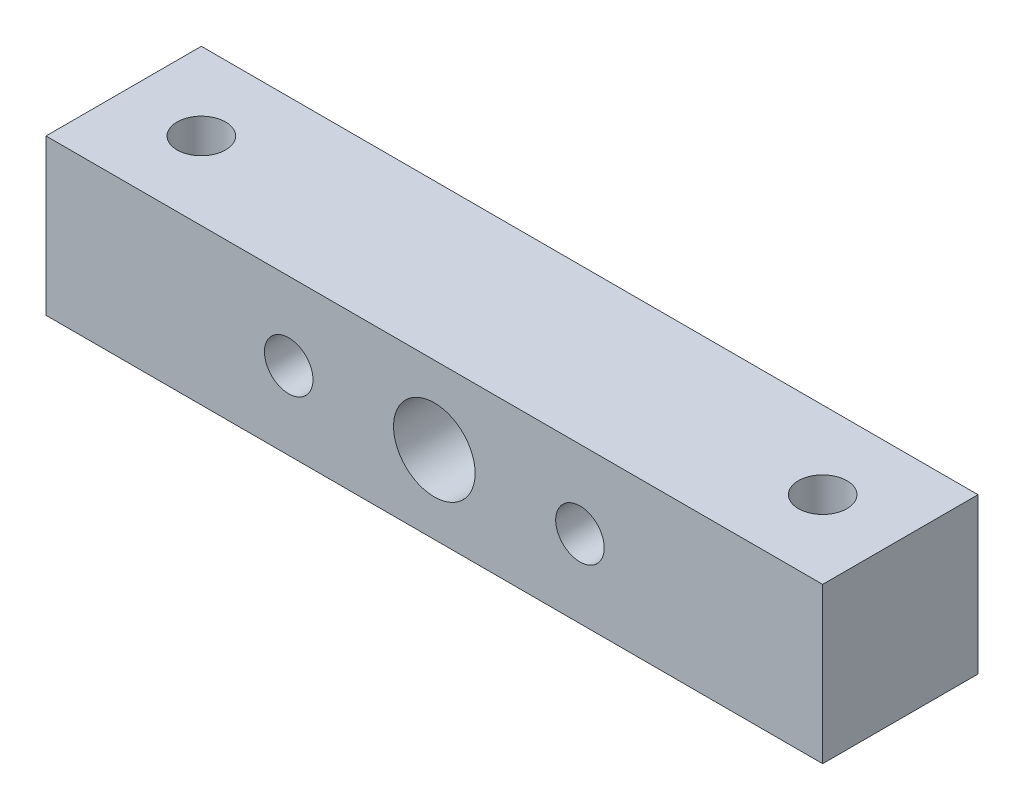
ISO-10303-21;
HEADER;
FILE_DESCRIPTION(('STEP AP214'),'2;1');
FILE_NAME('part.step','',(''),(''),'','','');
FILE_SCHEMA(('AUTOMOTIVE_DESIGN { 1 0 10303 214 1 1 1 1 }'));
ENDSEC;
DATA;
#1=APPLICATION_CONTEXT('core data for automotive mechanical design processes');
#2=APPLICATION_PROTOCOL_DEFINITION('international standard','automotive_design',2000,#1);
#3=PRODUCT_CONTEXT('',#1,'mechanical');
#4=PRODUCT('Part','Part','',(#3));
#5=PRODUCT_RELATED_PRODUCT_CATEGORY('part','',(#4));
#6=PRODUCT_DEFINITION_FORMATION('','',#4);
#7=PRODUCT_DEFINITION_CONTEXT('part definition',#1,'design');
#8=PRODUCT_DEFINITION('design','',#6,#7);
#9=PRODUCT_DEFINITION_SHAPE('','',#8);
#10=(LENGTH_UNIT() NAMED_UNIT(*) SI_UNIT(.MILLI.,.METRE.));
#11=(NAMED_UNIT(*) PLANE_ANGLE_UNIT() SI_UNIT($,.RADIAN.));
#12=(NAMED_UNIT(*) SI_UNIT($,.STERADIAN.) SOLID_ANGLE_UNIT());
#13=UNCERTAINTY_MEASURE_WITH_UNIT(LENGTH_MEASURE(1.E-05),#10,'distance_accuracy_value','');
#14=(GEOMETRIC_REPRESENTATION_CONTEXT(3) GLOBAL_UNCERTAINTY_ASSIGNED_CONTEXT((#13)) GLOBAL_UNIT_ASSIGNED_CONTEXT((#10,
#11,#12)) REPRESENTATION_CONTEXT('',''));
#15=CARTESIAN_POINT('',(0.,0.,0.));
#16=DIRECTION('',(0.,0.,1.));
#17=DIRECTION('',(1.,0.,0.));
#18=AXIS2_PLACEMENT_3D('',#15,#16,#17);
#19=CARTESIAN_POINT('',(0.,0.,8.));
#20=DIRECTION('',(0.,0.,1.));
#21=DIRECTION('',(1.,0.,0.));
#22=AXIS2_PLACEMENT_3D('',#19,#20,#21);
#23=PLANE('',#22);
#24=CARTESIAN_POINT('',(7.5,0.,8.));
#25=DIRECTION('',(0.,0.,1.));
#26=DIRECTION('',(1.,0.,0.));
#27=AXIS2_PLACEMENT_3D('',#24,#25,#26);
#28=CIRCLE('',#27,1.25);
#29=CARTESIAN_POINT('',(8.75,0.,8.));
#30=VERTEX_POINT('',#29);
#31=EDGE_CURVE('E116',#30,#30,#28,.T.);
#32=ORIENTED_EDGE('',*,*,#31,.F.);
#33=EDGE_LOOP('',(#32));
#34=FACE_BOUND('',#33,.T.);
#35=DIRECTION('',(0.,-1.,0.));
#36=VECTOR('',#35,1.);
#37=CARTESIAN_POINT('',(-20.,-4.,8.));
#38=LINE('',#37,#36);
#39=CARTESIAN_POINT('',(-20.,4.,8.));
#40=VERTEX_POINT('',#39);
#41=CARTESIAN_POINT('',(-20.,-4.,8.));
#42=VERTEX_POINT('',#41);
#43=EDGE_CURVE('E86',#40,#42,#38,.T.);
#44=ORIENTED_EDGE('',*,*,#43,.T.);
#45=DIRECTION('',(1.,0.,0.));
#46=VECTOR('',#45,1.);
#47=CARTESIAN_POINT('',(20.,-4.,8.));
#48=LINE('',#47,#46);
#49=CARTESIAN_POINT('',(20.,-4.,8.));
#50=VERTEX_POINT('',#49);
#51=EDGE_CURVE('E81',#42,#50,#48,.T.);
#52=ORIENTED_EDGE('',*,*,#51,.T.);
#53=DIRECTION('',(0.,1.,0.));
#54=VECTOR('',#53,1.);
#55=CARTESIAN_POINT('',(20.,-4.,8.));
#56=LINE('',#55,#54);
#57=CARTESIAN_POINT('',(20.,4.,8.));
#58=VERTEX_POINT('',#57);
#59=EDGE_CURVE('E84',#50,#58,#56,.T.);
#60=ORIENTED_EDGE('',*,*,#59,.T.);
#61=DIRECTION('',(-1.,0.,0.));
#62=VECTOR('',#61,1.);
#63=CARTESIAN_POINT('',(20.,4.,8.));
#64=LINE('',#63,#62);
#65=EDGE_CURVE('E51',#58,#40,#64,.T.);
#66=ORIENTED_EDGE('',*,*,#65,.T.);
#67=EDGE_LOOP('',(#44,#52,#60,#66));
#68=FACE_BOUND('',#67,.T.);
#69=CARTESIAN_POINT('',(0.,0.,8.));
#70=DIRECTION('',(0.,0.,1.));
#71=DIRECTION('',(1.,0.,0.));
#72=AXIS2_PLACEMENT_3D('',#69,#70,#71);
#73=CIRCLE('',#72,2.1);
#74=CARTESIAN_POINT('',(2.1,0.,8.));
#75=VERTEX_POINT('',#74);
#76=EDGE_CURVE('E101',#75,#75,#73,.T.);
#77=ORIENTED_EDGE('',*,*,#76,.F.);
#78=EDGE_LOOP('',(#77));
#79=FACE_BOUND('',#78,.T.);
#80=CARTESIAN_POINT('',(-7.5,0.,8.));
#81=DIRECTION('',(0.,0.,1.));
#82=DIRECTION('',(1.,0.,0.));
#83=AXIS2_PLACEMENT_3D('',#80,#81,#82);
#84=CIRCLE('',#83,1.25);
#85=CARTESIAN_POINT('',(-6.25,0.,8.));
#86=VERTEX_POINT('',#85);
#87=EDGE_CURVE('E122',#86,#86,#84,.T.);
#88=ORIENTED_EDGE('',*,*,#87,.F.);
#89=EDGE_LOOP('',(#88));
#90=FACE_BOUND('',#89,.T.);
#91=ADVANCED_FACE('F34',(#34,#68,#79,#90),#23,.T.);
#92=CARTESIAN_POINT('',(0.,0.,0.));
#93=DIRECTION('',(0.,0.,1.));
#94=DIRECTION('',(1.,0.,0.));
#95=AXIS2_PLACEMENT_3D('',#92,#93,#94);
#96=PLANE('',#95);
#97=CARTESIAN_POINT('',(7.5,0.,0.));
#98=DIRECTION('',(0.,0.,1.));
#99=DIRECTION('',(1.,0.,0.));
#100=AXIS2_PLACEMENT_3D('',#97,#98,#99);
#101=CIRCLE('',#100,1.25);
#102=CARTESIAN_POINT('',(8.75,0.,0.));
#103=VERTEX_POINT('',#102);
#104=EDGE_CURVE('E119',#103,#103,#101,.T.);
#105=ORIENTED_EDGE('',*,*,#104,.T.);
#106=EDGE_LOOP('',(#105));
#107=FACE_BOUND('',#106,.T.);
#108=DIRECTION('',(0.,-1.,0.));
#109=VECTOR('',#108,1.);
#110=CARTESIAN_POINT('',(-20.,-4.,0.));
#111=LINE('',#110,#109);
#112=CARTESIAN_POINT('',(-20.,4.,0.));
#113=VERTEX_POINT('',#112);
#114=CARTESIAN_POINT('',(-20.,-4.,0.));
#115=VERTEX_POINT('',#114);
#116=EDGE_CURVE('E98',#113,#115,#111,.T.);
#117=ORIENTED_EDGE('',*,*,#116,.F.);
#118=DIRECTION('',(-1.,0.,0.));
#119=VECTOR('',#118,1.);
#120=CARTESIAN_POINT('',(20.,4.,0.));
#121=LINE('',#120,#119);
#122=CARTESIAN_POINT('',(20.,4.,0.));
#123=VERTEX_POINT('',#122);
#124=EDGE_CURVE('E74',#123,#113,#121,.T.);
#125=ORIENTED_EDGE('',*,*,#124,.F.);
#126=DIRECTION('',(0.,1.,0.));
#127=VECTOR('',#126,1.);
#128=CARTESIAN_POINT('',(20.,-4.,0.));
#129=LINE('',#128,#127);
#130=CARTESIAN_POINT('',(20.,-4.,0.));
#131=VERTEX_POINT('',#130);
#132=EDGE_CURVE('E68',#131,#123,#129,.T.);
#133=ORIENTED_EDGE('',*,*,#132,.F.);
#134=DIRECTION('',(1.,0.,0.));
#135=VECTOR('',#134,1.);
#136=CARTESIAN_POINT('',(20.,-4.,0.));
#137=LINE('',#136,#135);
#138=EDGE_CURVE('E90',#115,#131,#137,.T.);
#139=ORIENTED_EDGE('',*,*,#138,.F.);
#140=EDGE_LOOP('',(#117,#125,#133,#139));
#141=FACE_BOUND('',#140,.T.);
#142=CARTESIAN_POINT('',(0.,0.,0.));
#143=DIRECTION('',(0.,0.,1.));
#144=DIRECTION('',(1.,0.,0.));
#145=AXIS2_PLACEMENT_3D('',#142,#143,#144);
#146=CIRCLE('',#145,2.1);
#147=CARTESIAN_POINT('',(2.1,0.,0.));
#148=VERTEX_POINT('',#147);
#149=EDGE_CURVE('E113',#148,#148,#146,.T.);
#150=ORIENTED_EDGE('',*,*,#149,.T.);
#151=EDGE_LOOP('',(#150));
#152=FACE_BOUND('',#151,.T.);
#153=CARTESIAN_POINT('',(-7.5,0.,0.));
#154=DIRECTION('',(0.,0.,1.));
#155=DIRECTION('',(1.,0.,0.));
#156=AXIS2_PLACEMENT_3D('',#153,#154,#155);
#157=CIRCLE('',#156,1.25);
#158=CARTESIAN_POINT('',(-6.25,0.,0.));
#159=VERTEX_POINT('',#158);
#160=EDGE_CURVE('E125',#159,#159,#157,.T.);
#161=ORIENTED_EDGE('',*,*,#160,.T.);
#162=EDGE_LOOP('',(#161));
#163=FACE_BOUND('',#162,.T.);
#164=ADVANCED_FACE('F109',(#107,#141,#152,#163),#96,.F.);
#165=CARTESIAN_POINT('',(-20.,-4.,8.));
#166=DIRECTION('',(1.,0.,0.));
#167=DIRECTION('',(0.,0.,-1.));
#168=AXIS2_PLACEMENT_3D('',#165,#166,#167);
#169=PLANE('',#168);
#170=ORIENTED_EDGE('',*,*,#116,.T.);
#171=DIRECTION('',(0.,0.,-1.));
#172=VECTOR('',#171,1.);
#173=CARTESIAN_POINT('',(-20.,-4.,8.));
#174=LINE('',#173,#172);
#175=EDGE_CURVE('E11',#42,#115,#174,.T.);
#176=ORIENTED_EDGE('',*,*,#175,.F.);
#177=ORIENTED_EDGE('',*,*,#43,.F.);
#178=DIRECTION('',(0.,0.,-1.));
#179=VECTOR('',#178,1.);
#180=CARTESIAN_POINT('',(-20.,4.,8.));
#181=LINE('',#180,#179);
#182=EDGE_CURVE('E94',#40,#113,#181,.T.);
#183=ORIENTED_EDGE('',*,*,#182,.T.);
#184=EDGE_LOOP('',(#170,#176,#177,#183));
#185=FACE_BOUND('',#184,.T.);
#186=ADVANCED_FACE('F36',(#185),#169,.F.);
#187=CARTESIAN_POINT('',(20.,-4.,8.));
#188=DIRECTION('',(0.,1.,0.));
#189=DIRECTION('',(-1.,0.,0.));
#190=AXIS2_PLACEMENT_3D('',#187,#188,#189);
#191=PLANE('',#190);
#192=CARTESIAN_POINT('',(16.,-4.,4.));
#193=DIRECTION('',(0.,-1.,0.));
#194=DIRECTION('',(1.,0.,0.));
#195=AXIS2_PLACEMENT_3D('',#192,#193,#194);
#196=CIRCLE('',#195,1.25);
#197=CARTESIAN_POINT('',(17.25,-4.,4.));
#198=VERTEX_POINT('',#197);
#199=EDGE_CURVE('E137',#198,#198,#196,.T.);
#200=ORIENTED_EDGE('',*,*,#199,.F.);
#201=EDGE_LOOP('',(#200));
#202=FACE_BOUND('',#201,.T.);
#203=CARTESIAN_POINT('',(-16.,-4.,4.));
#204=DIRECTION('',(0.,-1.,0.));
#205=DIRECTION('',(1.,0.,0.));
#206=AXIS2_PLACEMENT_3D('',#203,#204,#205);
#207=CIRCLE('',#206,1.25);
#208=CARTESIAN_POINT('',(-14.75,-4.,4.));
#209=VERTEX_POINT('',#208);
#210=EDGE_CURVE('E131',#209,#209,#207,.T.);
#211=ORIENTED_EDGE('',*,*,#210,.F.);
#212=EDGE_LOOP('',(#211));
#213=FACE_BOUND('',#212,.T.);
#214=ORIENTED_EDGE('',*,*,#138,.T.);
#215=DIRECTION('',(0.,0.,-1.));
#216=VECTOR('',#215,1.);
#217=CARTESIAN_POINT('',(20.,-4.,8.));
#218=LINE('',#217,#216);
#219=EDGE_CURVE('E43',#50,#131,#218,.T.);
#220=ORIENTED_EDGE('',*,*,#219,.F.);
#221=ORIENTED_EDGE('',*,*,#51,.F.);
#222=ORIENTED_EDGE('',*,*,#175,.T.);
#223=EDGE_LOOP('',(#214,#220,#221,#222));
#224=FACE_BOUND('',#223,.T.);
#225=ADVANCED_FACE('F89',(#202,#213,#224),#191,.F.);
#226=CARTESIAN_POINT('',(20.,-4.,8.));
#227=DIRECTION('',(-1.,0.,0.));
#228=DIRECTION('',(0.,0.,1.));
#229=AXIS2_PLACEMENT_3D('',#226,#227,#228);
#230=PLANE('',#229);
#231=ORIENTED_EDGE('',*,*,#132,.T.);
#232=DIRECTION('',(0.,0.,-1.));
#233=VECTOR('',#232,1.);
#234=CARTESIAN_POINT('',(20.,4.,8.));
#235=LINE('',#234,#233);
#236=EDGE_CURVE('E91',#58,#123,#235,.T.);
#237=ORIENTED_EDGE('',*,*,#236,.F.);
#238=ORIENTED_EDGE('',*,*,#59,.F.);
#239=ORIENTED_EDGE('',*,*,#219,.T.);
#240=EDGE_LOOP('',(#231,#237,#238,#239));
#241=FACE_BOUND('',#240,.T.);
#242=ADVANCED_FACE('F92',(#241),#230,.F.);
#243=CARTESIAN_POINT('',(20.,4.,8.));
#244=DIRECTION('',(0.,-1.,0.));
#245=DIRECTION('',(1.,0.,0.));
#246=AXIS2_PLACEMENT_3D('',#243,#244,#245);
#247=PLANE('',#246);
#248=CARTESIAN_POINT('',(16.,4.00000000000001,4.));
#249=DIRECTION('',(0.,-1.,0.));
#250=DIRECTION('',(1.,0.,0.));
#251=AXIS2_PLACEMENT_3D('',#248,#249,#250);
#252=CIRCLE('',#251,1.25);
#253=CARTESIAN_POINT('',(17.25,4.00000000000001,4.));
#254=VERTEX_POINT('',#253);
#255=EDGE_CURVE('E134',#254,#254,#252,.T.);
#256=ORIENTED_EDGE('',*,*,#255,.T.);
#257=EDGE_LOOP('',(#256));
#258=FACE_BOUND('',#257,.T.);
#259=CARTESIAN_POINT('',(-16.,4.,4.));
#260=DIRECTION('',(0.,-1.,0.));
#261=DIRECTION('',(1.,0.,0.));
#262=AXIS2_PLACEMENT_3D('',#259,#260,#261);
#263=CIRCLE('',#262,1.25);
#264=CARTESIAN_POINT('',(-14.75,4.,4.));
#265=VERTEX_POINT('',#264);
#266=EDGE_CURVE('E128',#265,#265,#263,.T.);
#267=ORIENTED_EDGE('',*,*,#266,.T.);
#268=EDGE_LOOP('',(#267));
#269=FACE_BOUND('',#268,.T.);
#270=ORIENTED_EDGE('',*,*,#124,.T.);
#271=ORIENTED_EDGE('',*,*,#182,.F.);
#272=ORIENTED_EDGE('',*,*,#65,.F.);
#273=ORIENTED_EDGE('',*,*,#236,.T.);
#274=EDGE_LOOP('',(#270,#271,#272,#273));
#275=FACE_BOUND('',#274,.T.);
#276=ADVANCED_FACE('F106',(#258,#269,#275),#247,.F.);
#277=CARTESIAN_POINT('',(0.,0.,8.));
#278=DIRECTION('',(0.,0.,-1.));
#279=DIRECTION('',(-1.,0.,0.));
#280=AXIS2_PLACEMENT_3D('',#277,#278,#279);
#281=CYLINDRICAL_SURFACE('',#280,2.1);
#282=ORIENTED_EDGE('',*,*,#76,.T.);
#283=EDGE_LOOP('',(#282));
#284=FACE_BOUND('',#283,.T.);
#285=ORIENTED_EDGE('',*,*,#149,.F.);
#286=EDGE_LOOP('',(#285));
#287=FACE_BOUND('',#286,.T.);
#288=ADVANCED_FACE('F177',(#284,#287),#281,.F.);
#289=CARTESIAN_POINT('',(7.5,0.,8.));
#290=DIRECTION('',(0.,0.,-1.));
#291=DIRECTION('',(-1.,0.,0.));
#292=AXIS2_PLACEMENT_3D('',#289,#290,#291);
#293=CYLINDRICAL_SURFACE('',#292,1.25);
#294=ORIENTED_EDGE('',*,*,#31,.T.);
#295=EDGE_LOOP('',(#294));
#296=FACE_BOUND('',#295,.T.);
#297=ORIENTED_EDGE('',*,*,#104,.F.);
#298=EDGE_LOOP('',(#297));
#299=FACE_BOUND('',#298,.T.);
#300=ADVANCED_FACE('F163',(#296,#299),#293,.F.);
#301=CARTESIAN_POINT('',(-7.5,0.,8.));
#302=DIRECTION('',(0.,0.,-1.));
#303=DIRECTION('',(-1.,0.,0.));
#304=AXIS2_PLACEMENT_3D('',#301,#302,#303);
#305=CYLINDRICAL_SURFACE('',#304,1.25);
#306=ORIENTED_EDGE('',*,*,#87,.T.);
#307=EDGE_LOOP('',(#306));
#308=FACE_BOUND('',#307,.T.);
#309=ORIENTED_EDGE('',*,*,#160,.F.);
#310=EDGE_LOOP('',(#309));
#311=FACE_BOUND('',#310,.T.);
#312=ADVANCED_FACE('F157',(#308,#311),#305,.F.);
#313=CARTESIAN_POINT('',(-16.,4.,4.));
#314=DIRECTION('',(0.,-1.,0.));
#315=DIRECTION('',(1.,0.,0.));
#316=AXIS2_PLACEMENT_3D('',#313,#314,#315);
#317=CYLINDRICAL_SURFACE('',#316,1.25);
#318=ORIENTED_EDGE('',*,*,#266,.F.);
#319=EDGE_LOOP('',(#318));
#320=FACE_BOUND('',#319,.T.);
#321=ORIENTED_EDGE('',*,*,#210,.T.);
#322=EDGE_LOOP('',(#321));
#323=FACE_BOUND('',#322,.T.);
#324=ADVANCED_FACE('F148',(#320,#323),#317,.F.);
#325=CARTESIAN_POINT('',(16.,4.00000000000001,4.));
#326=DIRECTION('',(0.,-1.,0.));
#327=DIRECTION('',(1.,0.,0.));
#328=AXIS2_PLACEMENT_3D('',#325,#326,#327);
#329=CYLINDRICAL_SURFACE('',#328,1.25);
#330=ORIENTED_EDGE('',*,*,#255,.F.);
#331=EDGE_LOOP('',(#330));
#332=FACE_BOUND('',#331,.T.);
#333=ORIENTED_EDGE('',*,*,#199,.T.);
#334=EDGE_LOOP('',(#333));
#335=FACE_BOUND('',#334,.T.);
#336=ADVANCED_FACE('F145',(#332,#335),#329,.F.);
#337=CLOSED_SHELL('',(#91,#164,#186,#225,#242,#276,#288,#300,#312,#324,#336));
#338=MANIFOLD_SOLID_BREP('B2',#337);
#339=ADVANCED_BREP_SHAPE_REPRESENTATION('',(#18,#338),#14);
#340=SHAPE_DEFINITION_REPRESENTATION(#9,#339);
ENDSEC;
END-ISO-10303-21;
